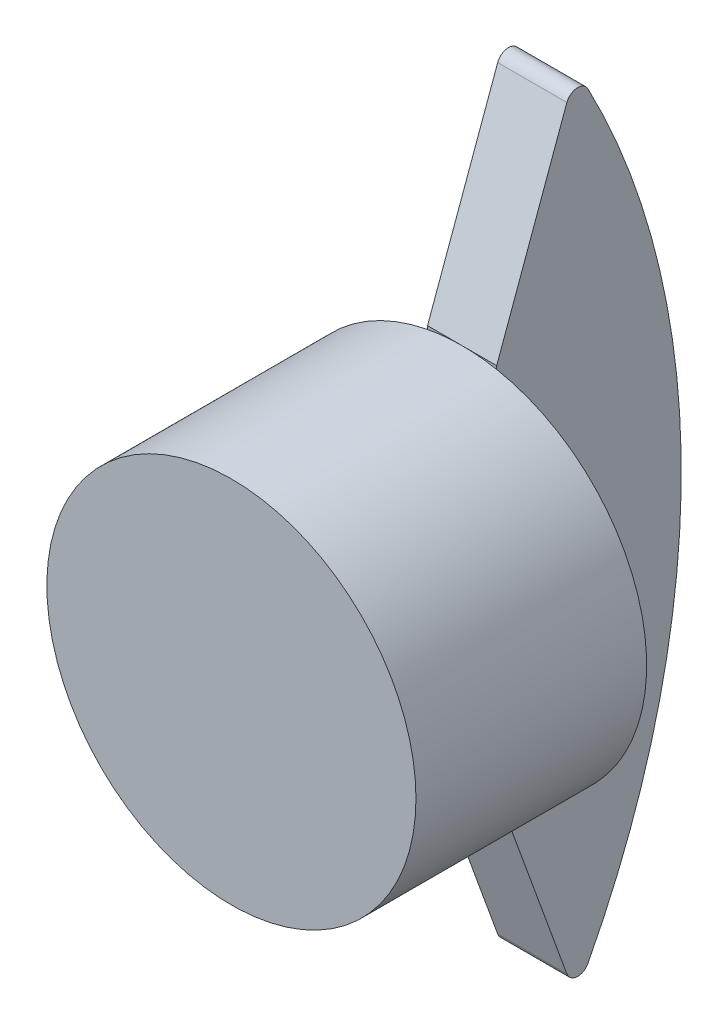
ISO-10303-21;
HEADER;
FILE_DESCRIPTION(('STEP AP214'),'2;1');
FILE_NAME('part.step','',(''),(''),'','','');
FILE_SCHEMA(('AUTOMOTIVE_DESIGN { 1 0 10303 214 1 1 1 1 }'));
ENDSEC;
DATA;
#1=APPLICATION_CONTEXT('core data for automotive mechanical design processes');
#2=APPLICATION_PROTOCOL_DEFINITION('international standard','automotive_design',2000,#1);
#3=PRODUCT_CONTEXT('',#1,'mechanical');
#4=PRODUCT('Part','Part','',(#3));
#5=PRODUCT_RELATED_PRODUCT_CATEGORY('part','',(#4));
#6=PRODUCT_DEFINITION_FORMATION('','',#4);
#7=PRODUCT_DEFINITION_CONTEXT('part definition',#1,'design');
#8=PRODUCT_DEFINITION('design','',#6,#7);
#9=PRODUCT_DEFINITION_SHAPE('','',#8);
#10=(LENGTH_UNIT() NAMED_UNIT(*) SI_UNIT(.MILLI.,.METRE.));
#11=(NAMED_UNIT(*) PLANE_ANGLE_UNIT() SI_UNIT($,.RADIAN.));
#12=(NAMED_UNIT(*) SI_UNIT($,.STERADIAN.) SOLID_ANGLE_UNIT());
#13=UNCERTAINTY_MEASURE_WITH_UNIT(LENGTH_MEASURE(1.E-05),#10,'distance_accuracy_value','');
#14=(GEOMETRIC_REPRESENTATION_CONTEXT(3) GLOBAL_UNCERTAINTY_ASSIGNED_CONTEXT((#13)) GLOBAL_UNIT_ASSIGNED_CONTEXT((#10,
#11,#12)) REPRESENTATION_CONTEXT('',''));
#15=CARTESIAN_POINT('',(0.,0.,0.));
#16=DIRECTION('',(0.,0.,1.));
#17=DIRECTION('',(1.,0.,0.));
#18=AXIS2_PLACEMENT_3D('',#15,#16,#17);
#19=CARTESIAN_POINT('',(0.,0.,0.));
#20=DIRECTION('',(0.,0.,1.));
#21=DIRECTION('',(1.,0.,0.));
#22=AXIS2_PLACEMENT_3D('',#19,#20,#21);
#23=PLANE('',#22);
#24=DIRECTION('',(0.,-1.,0.));
#25=VECTOR('',#24,1.);
#26=CARTESIAN_POINT('',(1.5,-8.,0.));
#27=LINE('',#26,#25);
#28=CARTESIAN_POINT('',(1.5,7.85811682275086,0.));
#29=VERTEX_POINT('',#28);
#30=CARTESIAN_POINT('',(1.5,-7.85811682275086,0.));
#31=VERTEX_POINT('',#30);
#32=EDGE_CURVE('E129',#29,#31,#27,.T.);
#33=ORIENTED_EDGE('',*,*,#32,.F.);
#34=CARTESIAN_POINT('',(0.,0.,0.));
#35=DIRECTION('',(0.,0.,1.));
#36=DIRECTION('',(1.,0.,0.));
#37=AXIS2_PLACEMENT_3D('',#34,#35,#36);
#38=CIRCLE('',#37,8.);
#39=EDGE_CURVE('E191',#31,#29,#38,.T.);
#40=ORIENTED_EDGE('',*,*,#39,.F.);
#41=EDGE_LOOP('',(#33,#40));
#42=FACE_BOUND('',#41,.T.);
#43=ADVANCED_FACE('F32',(#42),#23,.F.);
#44=CARTESIAN_POINT('',(0.,0.,10.));
#45=DIRECTION('',(0.,0.,-1.));
#46=DIRECTION('',(-1.,0.,0.));
#47=AXIS2_PLACEMENT_3D('',#44,#45,#46);
#48=CYLINDRICAL_SURFACE('',#47,8.);
#49=CARTESIAN_POINT('',(0.,0.,10.));
#50=DIRECTION('',(0.,0.,1.));
#51=DIRECTION('',(1.,0.,0.));
#52=AXIS2_PLACEMENT_3D('',#49,#50,#51);
#53=CIRCLE('',#52,8.);
#54=CARTESIAN_POINT('',(8.,0.,10.));
#55=VERTEX_POINT('',#54);
#56=EDGE_CURVE('E139',#55,#55,#53,.T.);
#57=ORIENTED_EDGE('',*,*,#56,.F.);
#58=EDGE_LOOP('',(#57));
#59=FACE_BOUND('',#58,.T.);
#60=CARTESIAN_POINT('',(0.,8.,0.));
#61=VERTEX_POINT('',#60);
#62=EDGE_CURVE('E126',#29,#61,#38,.T.);
#63=ORIENTED_EDGE('',*,*,#62,.T.);
#64=CARTESIAN_POINT('',(-1.5,7.85811682275086,0.));
#65=VERTEX_POINT('',#64);
#66=EDGE_CURVE('E200',#61,#65,#38,.T.);
#67=ORIENTED_EDGE('',*,*,#66,.T.);
#68=CARTESIAN_POINT('',(-1.5,-7.85811682275086,0.));
#69=VERTEX_POINT('',#68);
#70=EDGE_CURVE('E198',#65,#69,#38,.T.);
#71=ORIENTED_EDGE('',*,*,#70,.T.);
#72=CARTESIAN_POINT('',(0.,-8.,0.));
#73=VERTEX_POINT('',#72);
#74=EDGE_CURVE('E190',#69,#73,#38,.T.);
#75=ORIENTED_EDGE('',*,*,#74,.T.);
#76=EDGE_CURVE('E196',#73,#31,#38,.T.);
#77=ORIENTED_EDGE('',*,*,#76,.T.);
#78=ORIENTED_EDGE('',*,*,#39,.T.);
#79=EDGE_LOOP('',(#63,#67,#71,#75,#77,#78));
#80=FACE_BOUND('',#79,.T.);
#81=ADVANCED_FACE('F194',(#59,#80),#48,.T.);
#82=CARTESIAN_POINT('',(0.,0.,10.));
#83=DIRECTION('',(0.,0.,1.));
#84=DIRECTION('',(1.,0.,0.));
#85=AXIS2_PLACEMENT_3D('',#82,#83,#84);
#86=PLANE('',#85);
#87=ORIENTED_EDGE('',*,*,#56,.T.);
#88=EDGE_LOOP('',(#87));
#89=FACE_BOUND('',#88,.T.);
#90=ADVANCED_FACE('F208',(#89),#86,.T.);
#91=ORIENTED_EDGE('',*,*,#70,.F.);
#92=DIRECTION('',(0.,-1.,0.));
#93=VECTOR('',#92,1.);
#94=CARTESIAN_POINT('',(-1.5,-8.,0.));
#95=LINE('',#94,#93);
#96=EDGE_CURVE('E134',#65,#69,#95,.T.);
#97=ORIENTED_EDGE('',*,*,#96,.T.);
#98=EDGE_LOOP('',(#91,#97));
#99=FACE_BOUND('',#98,.T.);
#100=ADVANCED_FACE('F204',(#99),#23,.F.);
#101=CARTESIAN_POINT('',(-1.5,-8.,0.));
#102=DIRECTION('',(0.,0.,1.));
#103=DIRECTION('',(1.,0.,0.));
#104=AXIS2_PLACEMENT_3D('',#101,#102,#103);
#105=PLANE('',#104);
#106=ORIENTED_EDGE('',*,*,#62,.F.);
#107=CARTESIAN_POINT('',(1.5,8.,0.));
#108=VERTEX_POINT('',#107);
#109=EDGE_CURVE('E108',#108,#29,#27,.T.);
#110=ORIENTED_EDGE('',*,*,#109,.F.);
#111=DIRECTION('',(1.,0.,0.));
#112=VECTOR('',#111,1.);
#113=CARTESIAN_POINT('',(-1.5,8.,0.));
#114=LINE('',#113,#112);
#115=EDGE_CURVE('E117',#61,#108,#114,.T.);
#116=ORIENTED_EDGE('',*,*,#115,.F.);
#117=EDGE_LOOP('',(#106,#110,#116));
#118=FACE_BOUND('',#117,.T.);
#119=ADVANCED_FACE('F125',(#118),#105,.T.);
#120=ORIENTED_EDGE('',*,*,#66,.F.);
#121=CARTESIAN_POINT('',(-1.5,8.,0.));
#122=VERTEX_POINT('',#121);
#123=EDGE_CURVE('E120',#122,#61,#114,.T.);
#124=ORIENTED_EDGE('',*,*,#123,.F.);
#125=EDGE_CURVE('E123',#122,#65,#95,.T.);
#126=ORIENTED_EDGE('',*,*,#125,.T.);
#127=EDGE_LOOP('',(#120,#124,#126));
#128=FACE_BOUND('',#127,.T.);
#129=ADVANCED_FACE('F217',(#128),#105,.T.);
#130=ORIENTED_EDGE('',*,*,#74,.F.);
#131=CARTESIAN_POINT('',(-1.5,-8.,0.));
#132=VERTEX_POINT('',#131);
#133=EDGE_CURVE('E141',#69,#132,#95,.T.);
#134=ORIENTED_EDGE('',*,*,#133,.T.);
#135=DIRECTION('',(1.,0.,0.));
#136=VECTOR('',#135,1.);
#137=CARTESIAN_POINT('',(-1.5,-8.,0.));
#138=LINE('',#137,#136);
#139=EDGE_CURVE('E180',#132,#73,#138,.T.);
#140=ORIENTED_EDGE('',*,*,#139,.T.);
#141=EDGE_LOOP('',(#130,#134,#140));
#142=FACE_BOUND('',#141,.T.);
#143=ADVANCED_FACE('F189',(#142),#105,.T.);
#144=ORIENTED_EDGE('',*,*,#76,.F.);
#145=CARTESIAN_POINT('',(1.5,-8.,0.));
#146=VERTEX_POINT('',#145);
#147=EDGE_CURVE('E186',#73,#146,#138,.T.);
#148=ORIENTED_EDGE('',*,*,#147,.T.);
#149=EDGE_CURVE('E112',#31,#146,#27,.T.);
#150=ORIENTED_EDGE('',*,*,#149,.F.);
#151=EDGE_LOOP('',(#144,#148,#150));
#152=FACE_BOUND('',#151,.T.);
#153=ADVANCED_FACE('F219',(#152),#105,.T.);
#154=CARTESIAN_POINT('',(-1.5,-8.,0.));
#155=DIRECTION('',(0.,-0.342020143325663,0.93969262078591));
#156=DIRECTION('',(0.,-0.939692620785911,-0.342020143325663));
#157=AXIS2_PLACEMENT_3D('',#154,#155,#156);
#158=PLANE('',#157);
#159=DIRECTION('',(0.,-0.93969262078591,-0.342020143325663));
#160=VECTOR('',#159,1.);
#161=CARTESIAN_POINT('',(-1.5,-8.,0.));
#162=LINE('',#161,#160);
#163=CARTESIAN_POINT('',(-1.5,-16.3562388324798,-3.04142220544196));
#164=VERTEX_POINT('',#163);
#165=EDGE_CURVE('E127',#132,#164,#162,.T.);
#166=ORIENTED_EDGE('',*,*,#165,.T.);
#167=DIRECTION('',(1.,0.,0.));
#168=VECTOR('',#167,1.);
#169=CARTESIAN_POINT('',(-1.5,-16.3562388324798,-3.04142220544196));
#170=LINE('',#169,#168);
#171=CARTESIAN_POINT('',(1.5,-16.3562388324798,-3.04142220544196));
#172=VERTEX_POINT('',#171);
#173=EDGE_CURVE('E133',#164,#172,#170,.T.);
#174=ORIENTED_EDGE('',*,*,#173,.T.);
#175=DIRECTION('',(0.,-0.93969262078591,-0.342020143325663));
#176=VECTOR('',#175,1.);
#177=CARTESIAN_POINT('',(1.5,-8.,0.));
#178=LINE('',#177,#176);
#179=EDGE_CURVE('E182',#146,#172,#178,.T.);
#180=ORIENTED_EDGE('',*,*,#179,.F.);
#181=ORIENTED_EDGE('',*,*,#147,.F.);
#182=ORIENTED_EDGE('',*,*,#139,.F.);
#183=EDGE_LOOP('',(#166,#174,#180,#181,#182));
#184=FACE_BOUND('',#183,.T.);
#185=ADVANCED_FACE('F177',(#184),#158,.T.);
#186=CARTESIAN_POINT('',(-1.5,8.,0.));
#187=DIRECTION('',(0.,0.342020143325669,0.939692620785908));
#188=DIRECTION('',(0.,-0.939692620785908,0.342020143325669));
#189=AXIS2_PLACEMENT_3D('',#186,#187,#188);
#190=PLANE('',#189);
#191=DIRECTION('',(0.,-0.939692620785908,0.342020143325669));
#192=VECTOR('',#191,1.);
#193=CARTESIAN_POINT('',(1.5,8.,0.));
#194=LINE('',#193,#192);
#195=CARTESIAN_POINT('',(1.5,16.3562388324798,-3.04142220544202));
#196=VERTEX_POINT('',#195);
#197=EDGE_CURVE('E102',#196,#108,#194,.T.);
#198=ORIENTED_EDGE('',*,*,#197,.F.);
#199=DIRECTION('',(1.,0.,0.));
#200=VECTOR('',#199,1.);
#201=CARTESIAN_POINT('',(-1.5,16.3562388324798,-3.04142220544202));
#202=LINE('',#201,#200);
#203=CARTESIAN_POINT('',(-1.5,16.3562388324798,-3.04142220544202));
#204=VERTEX_POINT('',#203);
#205=EDGE_CURVE('E11',#196,#204,#202,.F.);
#206=ORIENTED_EDGE('',*,*,#205,.T.);
#207=DIRECTION('',(0.,-0.939692620785908,0.342020143325669));
#208=VECTOR('',#207,1.);
#209=CARTESIAN_POINT('',(-1.5,8.,0.));
#210=LINE('',#209,#208);
#211=EDGE_CURVE('E150',#204,#122,#210,.T.);
#212=ORIENTED_EDGE('',*,*,#211,.T.);
#213=ORIENTED_EDGE('',*,*,#123,.T.);
#214=ORIENTED_EDGE('',*,*,#115,.T.);
#215=EDGE_LOOP('',(#198,#206,#212,#213,#214));
#216=FACE_BOUND('',#215,.T.);
#217=ADVANCED_FACE('F118',(#216),#190,.T.);
#218=CARTESIAN_POINT('',(-1.5,0.,27.3320775659974));
#219=DIRECTION('',(1.,0.,0.));
#220=DIRECTION('',(0.,0.,-1.));
#221=AXIS2_PLACEMENT_3D('',#218,#219,#220);
#222=CYLINDRICAL_SURFACE('',#221,35.3320775659974);
#223=CARTESIAN_POINT('',(1.5,0.,27.3320775659974));
#224=DIRECTION('',(1.,0.,0.));
#225=DIRECTION('',(0.,0.,-1.));
#226=AXIS2_PLACEMENT_3D('',#223,#224,#225);
#227=CIRCLE('',#226,35.3320775659974);
#228=CARTESIAN_POINT('',(1.5,-16.417560994376,-3.95401193278144));
#229=VERTEX_POINT('',#228);
#230=CARTESIAN_POINT('',(1.5,16.417560994376,-3.95401193278151));
#231=VERTEX_POINT('',#230);
#232=EDGE_CURVE('E113',#229,#231,#227,.T.);
#233=ORIENTED_EDGE('',*,*,#232,.F.);
#234=DIRECTION('',(1.,0.,0.));
#235=VECTOR('',#234,1.);
#236=CARTESIAN_POINT('',(-1.5,-16.417560994376,-3.95401193278144));
#237=LINE('',#236,#235);
#238=CARTESIAN_POINT('',(-1.5,-16.417560994376,-3.95401193278144));
#239=VERTEX_POINT('',#238);
#240=EDGE_CURVE('E163',#229,#239,#237,.F.);
#241=ORIENTED_EDGE('',*,*,#240,.T.);
#242=CARTESIAN_POINT('',(-1.5,0.,27.3320775659974));
#243=DIRECTION('',(1.,0.,0.));
#244=DIRECTION('',(0.,0.,-1.));
#245=AXIS2_PLACEMENT_3D('',#242,#243,#244);
#246=CIRCLE('',#245,35.3320775659974);
#247=CARTESIAN_POINT('',(-1.5,16.417560994376,-3.95401193278151));
#248=VERTEX_POINT('',#247);
#249=EDGE_CURVE('E131',#239,#248,#246,.T.);
#250=ORIENTED_EDGE('',*,*,#249,.T.);
#251=DIRECTION('',(1.,0.,0.));
#252=VECTOR('',#251,1.);
#253=CARTESIAN_POINT('',(-1.5,16.417560994376,-3.95401193278151));
#254=LINE('',#253,#252);
#255=EDGE_CURVE('E161',#248,#231,#254,.T.);
#256=ORIENTED_EDGE('',*,*,#255,.T.);
#257=EDGE_LOOP('',(#233,#241,#250,#256));
#258=FACE_BOUND('',#257,.T.);
#259=ADVANCED_FACE('F160',(#258),#222,.T.);
#260=CARTESIAN_POINT('',(-1.5,0.,27.3320775659974));
#261=DIRECTION('',(1.,0.,0.));
#262=DIRECTION('',(0.,0.,-1.));
#263=AXIS2_PLACEMENT_3D('',#260,#261,#262);
#264=PLANE('',#263);
#265=ORIENTED_EDGE('',*,*,#249,.F.);
#266=CARTESIAN_POINT('',(-1.5,-16.185228760817,-3.51126851583491));
#267=DIRECTION('',(1.,0.,0.));
#268=DIRECTION('',(0.,0.,-1.));
#269=AXIS2_PLACEMENT_3D('',#266,#267,#268);
#270=CIRCLE('',#269,0.5);
#271=EDGE_CURVE('E40',#239,#164,#270,.F.);
#272=ORIENTED_EDGE('',*,*,#271,.T.);
#273=ORIENTED_EDGE('',*,*,#165,.F.);
#274=ORIENTED_EDGE('',*,*,#133,.F.);
#275=ORIENTED_EDGE('',*,*,#96,.F.);
#276=ORIENTED_EDGE('',*,*,#125,.F.);
#277=ORIENTED_EDGE('',*,*,#211,.F.);
#278=CARTESIAN_POINT('',(-1.5,16.185228760817,-3.51126851583498));
#279=DIRECTION('',(1.,0.,0.));
#280=DIRECTION('',(0.,0.,-1.));
#281=AXIS2_PLACEMENT_3D('',#278,#279,#280);
#282=CIRCLE('',#281,0.5);
#283=EDGE_CURVE('E52',#204,#248,#282,.F.);
#284=ORIENTED_EDGE('',*,*,#283,.T.);
#285=EDGE_LOOP('',(#265,#272,#273,#274,#275,#276,#277,#284));
#286=FACE_BOUND('',#285,.T.);
#287=ADVANCED_FACE('F173',(#286),#264,.F.);
#288=CARTESIAN_POINT('',(1.5,0.,27.3320775659974));
#289=DIRECTION('',(1.,0.,0.));
#290=DIRECTION('',(0.,0.,-1.));
#291=AXIS2_PLACEMENT_3D('',#288,#289,#290);
#292=PLANE('',#291);
#293=ORIENTED_EDGE('',*,*,#179,.T.);
#294=CARTESIAN_POINT('',(1.5,-16.185228760817,-3.51126851583491));
#295=DIRECTION('',(1.,0.,0.));
#296=DIRECTION('',(0.,0.,-1.));
#297=AXIS2_PLACEMENT_3D('',#294,#295,#296);
#298=CIRCLE('',#297,0.5);
#299=EDGE_CURVE('E166',#172,#229,#298,.T.);
#300=ORIENTED_EDGE('',*,*,#299,.T.);
#301=ORIENTED_EDGE('',*,*,#232,.T.);
#302=CARTESIAN_POINT('',(1.5,16.185228760817,-3.51126851583498));
#303=DIRECTION('',(1.,0.,0.));
#304=DIRECTION('',(0.,0.,-1.));
#305=AXIS2_PLACEMENT_3D('',#302,#303,#304);
#306=CIRCLE('',#305,0.5);
#307=EDGE_CURVE('E111',#231,#196,#306,.T.);
#308=ORIENTED_EDGE('',*,*,#307,.T.);
#309=ORIENTED_EDGE('',*,*,#197,.T.);
#310=ORIENTED_EDGE('',*,*,#109,.T.);
#311=ORIENTED_EDGE('',*,*,#32,.T.);
#312=ORIENTED_EDGE('',*,*,#149,.T.);
#313=EDGE_LOOP('',(#293,#300,#301,#308,#309,#310,#311,#312));
#314=FACE_BOUND('',#313,.T.);
#315=ADVANCED_FACE('F105',(#314),#292,.T.);
#316=CARTESIAN_POINT('',(-1.5,-16.185228760817,-3.51126851583491));
#317=DIRECTION('',(1.,0.,0.));
#318=DIRECTION('',(0.,0.,-1.));
#319=AXIS2_PLACEMENT_3D('',#316,#317,#318);
#320=CYLINDRICAL_SURFACE('',#319,0.5);
#321=ORIENTED_EDGE('',*,*,#271,.F.);
#322=ORIENTED_EDGE('',*,*,#240,.F.);
#323=ORIENTED_EDGE('',*,*,#299,.F.);
#324=ORIENTED_EDGE('',*,*,#173,.F.);
#325=EDGE_LOOP('',(#321,#322,#323,#324));
#326=FACE_BOUND('',#325,.T.);
#327=ADVANCED_FACE('F181',(#326),#320,.T.);
#328=CARTESIAN_POINT('',(-1.5,16.185228760817,-3.51126851583498));
#329=DIRECTION('',(1.,0.,0.));
#330=DIRECTION('',(0.,0.,-1.));
#331=AXIS2_PLACEMENT_3D('',#328,#329,#330);
#332=CYLINDRICAL_SURFACE('',#331,0.5);
#333=ORIENTED_EDGE('',*,*,#283,.F.);
#334=ORIENTED_EDGE('',*,*,#205,.F.);
#335=ORIENTED_EDGE('',*,*,#307,.F.);
#336=ORIENTED_EDGE('',*,*,#255,.F.);
#337=EDGE_LOOP('',(#333,#334,#335,#336));
#338=FACE_BOUND('',#337,.T.);
#339=ADVANCED_FACE('F34',(#338),#332,.T.);
#340=CLOSED_SHELL('',(#43,#81,#90,#100,#119,#129,#143,#153,#185,#217,#259,#287,#315,#327,#339));
#341=MANIFOLD_SOLID_BREP('B2',#340);
#342=ADVANCED_BREP_SHAPE_REPRESENTATION('',(#18,#341),#14);
#343=SHAPE_DEFINITION_REPRESENTATION(#9,#342);
ENDSEC;
END-ISO-10303-21;
